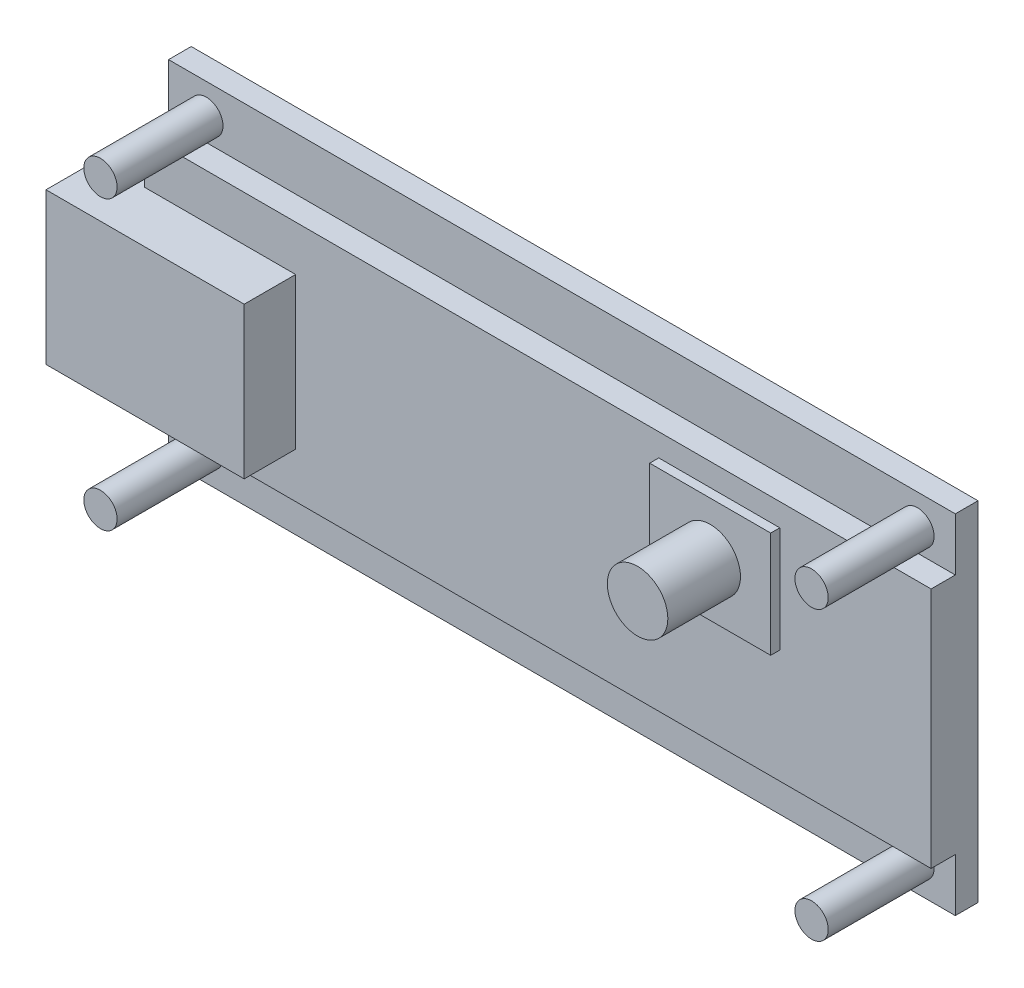
ISO-10303-21;
HEADER;
FILE_DESCRIPTION(('STEP AP214'),'2;1');
FILE_NAME('part.step','',(''),(''),'','','');
FILE_SCHEMA(('AUTOMOTIVE_DESIGN { 1 0 10303 214 1 1 1 1 }'));
ENDSEC;
DATA;
#1=APPLICATION_CONTEXT('core data for automotive mechanical design processes');
#2=APPLICATION_PROTOCOL_DEFINITION('international standard','automotive_design',2000,#1);
#3=PRODUCT_CONTEXT('',#1,'mechanical');
#4=PRODUCT('Part','Part','',(#3));
#5=PRODUCT_RELATED_PRODUCT_CATEGORY('part','',(#4));
#6=PRODUCT_DEFINITION_FORMATION('','',#4);
#7=PRODUCT_DEFINITION_CONTEXT('part definition',#1,'design');
#8=PRODUCT_DEFINITION('design','',#6,#7);
#9=PRODUCT_DEFINITION_SHAPE('','',#8);
#10=(LENGTH_UNIT() NAMED_UNIT(*) SI_UNIT(.MILLI.,.METRE.));
#11=(NAMED_UNIT(*) PLANE_ANGLE_UNIT() SI_UNIT($,.RADIAN.));
#12=(NAMED_UNIT(*) SI_UNIT($,.STERADIAN.) SOLID_ANGLE_UNIT());
#13=UNCERTAINTY_MEASURE_WITH_UNIT(LENGTH_MEASURE(1.E-05),#10,'distance_accuracy_value','');
#14=(GEOMETRIC_REPRESENTATION_CONTEXT(3) GLOBAL_UNCERTAINTY_ASSIGNED_CONTEXT((#13)) GLOBAL_UNIT_ASSIGNED_CONTEXT((#10,
#11,#12)) REPRESENTATION_CONTEXT('',''));
#15=CARTESIAN_POINT('',(0.,0.,0.));
#16=DIRECTION('',(0.,0.,1.));
#17=DIRECTION('',(1.,0.,0.));
#18=AXIS2_PLACEMENT_3D('',#15,#16,#17);
#19=CARTESIAN_POINT('',(0.,0.,-1.5));
#20=DIRECTION('',(-1.,0.,0.));
#21=DIRECTION('',(0.,0.,1.));
#22=AXIS2_PLACEMENT_3D('',#19,#20,#21);
#23=PLANE('',#22);
#24=DIRECTION('',(0.,-1.,0.));
#25=VECTOR('',#24,1.);
#26=CARTESIAN_POINT('',(0.,0.,-1.5));
#27=LINE('',#26,#25);
#28=CARTESIAN_POINT('',(0.,23.,-1.5));
#29=VERTEX_POINT('',#28);
#30=CARTESIAN_POINT('',(0.,16.5,-1.5));
#31=VERTEX_POINT('',#30);
#32=EDGE_CURVE('E278',#29,#31,#27,.T.);
#33=ORIENTED_EDGE('',*,*,#32,.T.);
#34=DIRECTION('',(0.,0.,1.));
#35=VECTOR('',#34,1.);
#36=CARTESIAN_POINT('',(0.,16.5,5.));
#37=LINE('',#36,#35);
#38=CARTESIAN_POINT('',(0.,16.5,1.6));
#39=VERTEX_POINT('',#38);
#40=EDGE_CURVE('E165',#31,#39,#37,.T.);
#41=ORIENTED_EDGE('',*,*,#40,.T.);
#42=DIRECTION('',(0.,-1.,0.));
#43=VECTOR('',#42,1.);
#44=CARTESIAN_POINT('',(0.,3.49999999999999,1.6));
#45=LINE('',#44,#43);
#46=CARTESIAN_POINT('',(0.,19.5,1.6));
#47=VERTEX_POINT('',#46);
#48=EDGE_CURVE('E229',#47,#39,#45,.T.);
#49=ORIENTED_EDGE('',*,*,#48,.F.);
#50=DIRECTION('',(0.,0.,-1.));
#51=VECTOR('',#50,1.);
#52=CARTESIAN_POINT('',(0.,19.5,1.6));
#53=LINE('',#52,#51);
#54=CARTESIAN_POINT('',(0.,19.5,0.));
#55=VERTEX_POINT('',#54);
#56=EDGE_CURVE('E240',#47,#55,#53,.T.);
#57=ORIENTED_EDGE('',*,*,#56,.T.);
#58=DIRECTION('',(0.,-1.,0.));
#59=VECTOR('',#58,1.);
#60=CARTESIAN_POINT('',(0.,0.,0.));
#61=LINE('',#60,#59);
#62=CARTESIAN_POINT('',(0.,23.,0.));
#63=VERTEX_POINT('',#62);
#64=EDGE_CURVE('E291',#63,#55,#61,.T.);
#65=ORIENTED_EDGE('',*,*,#64,.F.);
#66=DIRECTION('',(0.,0.,1.));
#67=VECTOR('',#66,1.);
#68=CARTESIAN_POINT('',(0.,23.,-1.5));
#69=LINE('',#68,#67);
#70=EDGE_CURVE('E304',#29,#63,#69,.T.);
#71=ORIENTED_EDGE('',*,*,#70,.F.);
#72=EDGE_LOOP('',(#33,#41,#49,#57,#65,#71));
#73=FACE_BOUND('',#72,.T.);
#74=ADVANCED_FACE('F35',(#73),#23,.T.);
#75=CARTESIAN_POINT('',(0.,0.,2.2));
#76=DIRECTION('',(0.,0.,1.));
#77=DIRECTION('',(1.,0.,0.));
#78=AXIS2_PLACEMENT_3D('',#75,#76,#77);
#79=PLANE('',#78);
#80=DIRECTION('',(1.,0.,0.));
#81=VECTOR('',#80,1.);
#82=CARTESIAN_POINT('',(34.,11.,2.2));
#83=LINE('',#82,#81);
#84=CARTESIAN_POINT('',(34.,11.,2.2));
#85=VERTEX_POINT('',#84);
#86=CARTESIAN_POINT('',(42.,11.,2.2));
#87=VERTEX_POINT('',#86);
#88=EDGE_CURVE('E198',#85,#87,#83,.T.);
#89=ORIENTED_EDGE('',*,*,#88,.T.);
#90=DIRECTION('',(0.,1.,0.));
#91=VECTOR('',#90,1.);
#92=CARTESIAN_POINT('',(42.,11.,2.2));
#93=LINE('',#92,#91);
#94=CARTESIAN_POINT('',(42.,18.,2.2));
#95=VERTEX_POINT('',#94);
#96=EDGE_CURVE('E201',#87,#95,#93,.T.);
#97=ORIENTED_EDGE('',*,*,#96,.T.);
#98=DIRECTION('',(1.,0.,0.));
#99=VECTOR('',#98,1.);
#100=CARTESIAN_POINT('',(34.,18.,2.2));
#101=LINE('',#100,#99);
#102=CARTESIAN_POINT('',(34.,18.,2.2));
#103=VERTEX_POINT('',#102);
#104=EDGE_CURVE('E203',#103,#95,#101,.T.);
#105=ORIENTED_EDGE('',*,*,#104,.F.);
#106=DIRECTION('',(0.,1.,0.));
#107=VECTOR('',#106,1.);
#108=CARTESIAN_POINT('',(34.,11.,2.2));
#109=LINE('',#108,#107);
#110=EDGE_CURVE('E206',#85,#103,#109,.T.);
#111=ORIENTED_EDGE('',*,*,#110,.F.);
#112=EDGE_LOOP('',(#89,#97,#105,#111));
#113=FACE_BOUND('',#112,.T.);
#114=CARTESIAN_POINT('',(38.,14.5,2.2));
#115=DIRECTION('',(0.,0.,1.));
#116=DIRECTION('',(1.,0.,0.));
#117=AXIS2_PLACEMENT_3D('',#114,#115,#116);
#118=CIRCLE('',#117,2.);
#119=CARTESIAN_POINT('',(40.,14.5,2.2));
#120=VERTEX_POINT('',#119);
#121=EDGE_CURVE('E39',#120,#120,#118,.F.);
#122=ORIENTED_EDGE('',*,*,#121,.T.);
#123=EDGE_LOOP('',(#122));
#124=FACE_BOUND('',#123,.T.);
#125=ADVANCED_FACE('F329',(#113,#124),#79,.T.);
#126=CARTESIAN_POINT('',(0.,0.,1.6));
#127=DIRECTION('',(0.,0.,1.));
#128=DIRECTION('',(1.,0.,0.));
#129=AXIS2_PLACEMENT_3D('',#126,#127,#128);
#130=PLANE('',#129);
#131=DIRECTION('',(1.,0.,0.));
#132=VECTOR('',#131,1.);
#133=CARTESIAN_POINT('',(-1.1,6.49999999999999,1.6));
#134=LINE('',#133,#132);
#135=CARTESIAN_POINT('',(0.,6.49999999999999,1.6));
#136=VERTEX_POINT('',#135);
#137=CARTESIAN_POINT('',(10.,6.49999999999999,1.6));
#138=VERTEX_POINT('',#137);
#139=EDGE_CURVE('E248',#136,#138,#134,.T.);
#140=ORIENTED_EDGE('',*,*,#139,.F.);
#141=CARTESIAN_POINT('',(0.,3.49999999999999,1.6));
#142=VERTEX_POINT('',#141);
#143=EDGE_CURVE('E228',#136,#142,#45,.T.);
#144=ORIENTED_EDGE('',*,*,#143,.T.);
#145=DIRECTION('',(1.,0.,0.));
#146=VECTOR('',#145,1.);
#147=CARTESIAN_POINT('',(52.,3.5,1.6));
#148=LINE('',#147,#146);
#149=CARTESIAN_POINT('',(52.,3.5,1.6));
#150=VERTEX_POINT('',#149);
#151=EDGE_CURVE('E231',#142,#150,#148,.T.);
#152=ORIENTED_EDGE('',*,*,#151,.T.);
#153=DIRECTION('',(0.,1.,0.));
#154=VECTOR('',#153,1.);
#155=CARTESIAN_POINT('',(52.,3.5,1.6));
#156=LINE('',#155,#154);
#157=CARTESIAN_POINT('',(52.,19.5,1.6));
#158=VERTEX_POINT('',#157);
#159=EDGE_CURVE('E222',#150,#158,#156,.T.);
#160=ORIENTED_EDGE('',*,*,#159,.T.);
#161=DIRECTION('',(-1.,0.,0.));
#162=VECTOR('',#161,1.);
#163=CARTESIAN_POINT('',(52.,19.5,1.6));
#164=LINE('',#163,#162);
#165=EDGE_CURVE('E225',#158,#47,#164,.T.);
#166=ORIENTED_EDGE('',*,*,#165,.T.);
#167=ORIENTED_EDGE('',*,*,#48,.T.);
#168=DIRECTION('',(-1.,0.,0.));
#169=VECTOR('',#168,1.);
#170=CARTESIAN_POINT('',(-1.1,16.5,1.6));
#171=LINE('',#170,#169);
#172=CARTESIAN_POINT('',(10.,16.5,1.6));
#173=VERTEX_POINT('',#172);
#174=EDGE_CURVE('E306',#173,#39,#171,.T.);
#175=ORIENTED_EDGE('',*,*,#174,.F.);
#176=DIRECTION('',(0.,1.,0.));
#177=VECTOR('',#176,1.);
#178=CARTESIAN_POINT('',(10.,16.5,1.6));
#179=LINE('',#178,#177);
#180=EDGE_CURVE('E245',#138,#173,#179,.T.);
#181=ORIENTED_EDGE('',*,*,#180,.F.);
#182=EDGE_LOOP('',(#140,#144,#152,#160,#166,#167,#175,#181));
#183=FACE_BOUND('',#182,.T.);
#184=DIRECTION('',(0.,-1.,0.));
#185=VECTOR('',#184,1.);
#186=CARTESIAN_POINT('',(42.,0.,1.6));
#187=LINE('',#186,#185);
#188=CARTESIAN_POINT('',(42.,18.,1.6));
#189=VERTEX_POINT('',#188);
#190=CARTESIAN_POINT('',(42.,11.,1.6));
#191=VERTEX_POINT('',#190);
#192=EDGE_CURVE('E44',#189,#191,#187,.T.);
#193=ORIENTED_EDGE('',*,*,#192,.T.);
#194=DIRECTION('',(-1.,0.,0.));
#195=VECTOR('',#194,1.);
#196=CARTESIAN_POINT('',(0.,11.,1.6));
#197=LINE('',#196,#195);
#198=CARTESIAN_POINT('',(34.,11.,1.6));
#199=VERTEX_POINT('',#198);
#200=EDGE_CURVE('E11',#191,#199,#197,.T.);
#201=ORIENTED_EDGE('',*,*,#200,.T.);
#202=DIRECTION('',(0.,-1.,0.));
#203=VECTOR('',#202,1.);
#204=CARTESIAN_POINT('',(34.,0.,1.6));
#205=LINE('',#204,#203);
#206=CARTESIAN_POINT('',(34.,18.,1.6));
#207=VERTEX_POINT('',#206);
#208=EDGE_CURVE('E316',#207,#199,#205,.T.);
#209=ORIENTED_EDGE('',*,*,#208,.F.);
#210=DIRECTION('',(-1.,0.,0.));
#211=VECTOR('',#210,1.);
#212=CARTESIAN_POINT('',(0.,18.,1.6));
#213=LINE('',#212,#211);
#214=EDGE_CURVE('E54',#189,#207,#213,.T.);
#215=ORIENTED_EDGE('',*,*,#214,.F.);
#216=EDGE_LOOP('',(#193,#201,#209,#215));
#217=FACE_BOUND('',#216,.T.);
#218=ADVANCED_FACE('F336',(#183,#217),#130,.T.);
#219=CARTESIAN_POINT('',(0.,0.,0.));
#220=DIRECTION('',(0.,0.,-1.));
#221=DIRECTION('',(-1.,0.,0.));
#222=AXIS2_PLACEMENT_3D('',#219,#220,#221);
#223=PLANE('',#222);
#224=CARTESIAN_POINT('',(49.5,21.,0.));
#225=DIRECTION('',(0.,0.,1.));
#226=DIRECTION('',(1.,0.,0.));
#227=AXIS2_PLACEMENT_3D('',#224,#225,#226);
#228=CIRCLE('',#227,1.1);
#229=CARTESIAN_POINT('',(50.6,21.,0.));
#230=VERTEX_POINT('',#229);
#231=EDGE_CURVE('E271',#230,#230,#228,.T.);
#232=ORIENTED_EDGE('',*,*,#231,.F.);
#233=EDGE_LOOP('',(#232));
#234=FACE_BOUND('',#233,.T.);
#235=CARTESIAN_POINT('',(2.5,21.,0.));
#236=DIRECTION('',(0.,0.,1.));
#237=DIRECTION('',(1.,0.,0.));
#238=AXIS2_PLACEMENT_3D('',#235,#236,#237);
#239=CIRCLE('',#238,1.1);
#240=CARTESIAN_POINT('',(3.6,21.,0.));
#241=VERTEX_POINT('',#240);
#242=EDGE_CURVE('E274',#241,#241,#239,.T.);
#243=ORIENTED_EDGE('',*,*,#242,.F.);
#244=EDGE_LOOP('',(#243));
#245=FACE_BOUND('',#244,.T.);
#246=DIRECTION('',(-1.,0.,0.));
#247=VECTOR('',#246,1.);
#248=CARTESIAN_POINT('',(52.,19.5,0.));
#249=LINE('',#248,#247);
#250=CARTESIAN_POINT('',(52.,19.5,0.));
#251=VERTEX_POINT('',#250);
#252=EDGE_CURVE('E221',#251,#55,#249,.T.);
#253=ORIENTED_EDGE('',*,*,#252,.F.);
#254=DIRECTION('',(0.,1.,0.));
#255=VECTOR('',#254,1.);
#256=CARTESIAN_POINT('',(52.,0.,0.));
#257=LINE('',#256,#255);
#258=CARTESIAN_POINT('',(52.,23.,0.));
#259=VERTEX_POINT('',#258);
#260=EDGE_CURVE('E297',#251,#259,#257,.T.);
#261=ORIENTED_EDGE('',*,*,#260,.T.);
#262=DIRECTION('',(-1.,0.,0.));
#263=VECTOR('',#262,1.);
#264=CARTESIAN_POINT('',(0.,23.,0.));
#265=LINE('',#264,#263);
#266=EDGE_CURVE('E301',#259,#63,#265,.T.);
#267=ORIENTED_EDGE('',*,*,#266,.T.);
#268=ORIENTED_EDGE('',*,*,#64,.T.);
#269=EDGE_LOOP('',(#253,#261,#267,#268));
#270=FACE_BOUND('',#269,.T.);
#271=ADVANCED_FACE('F338',(#234,#245,#270),#223,.F.);
#272=CARTESIAN_POINT('',(49.5,2.,0.));
#273=DIRECTION('',(0.,0.,1.));
#274=DIRECTION('',(1.,0.,0.));
#275=AXIS2_PLACEMENT_3D('',#272,#273,#274);
#276=CIRCLE('',#275,1.1);
#277=CARTESIAN_POINT('',(50.6,2.,0.));
#278=VERTEX_POINT('',#277);
#279=EDGE_CURVE('E265',#278,#278,#276,.T.);
#280=ORIENTED_EDGE('',*,*,#279,.F.);
#281=EDGE_LOOP('',(#280));
#282=FACE_BOUND('',#281,.T.);
#283=CARTESIAN_POINT('',(2.5,2.,0.));
#284=DIRECTION('',(0.,0.,1.));
#285=DIRECTION('',(1.,0.,0.));
#286=AXIS2_PLACEMENT_3D('',#283,#284,#285);
#287=CIRCLE('',#286,1.1);
#288=CARTESIAN_POINT('',(3.6,2.,0.));
#289=VERTEX_POINT('',#288);
#290=EDGE_CURVE('E268',#289,#289,#287,.T.);
#291=ORIENTED_EDGE('',*,*,#290,.F.);
#292=EDGE_LOOP('',(#291));
#293=FACE_BOUND('',#292,.T.);
#294=DIRECTION('',(1.,0.,0.));
#295=VECTOR('',#294,1.);
#296=CARTESIAN_POINT('',(52.,3.5,0.));
#297=LINE('',#296,#295);
#298=CARTESIAN_POINT('',(0.,3.49999999999999,0.));
#299=VERTEX_POINT('',#298);
#300=CARTESIAN_POINT('',(52.,3.5,0.));
#301=VERTEX_POINT('',#300);
#302=EDGE_CURVE('E226',#299,#301,#297,.T.);
#303=ORIENTED_EDGE('',*,*,#302,.F.);
#304=CARTESIAN_POINT('',(0.,0.,0.));
#305=VERTEX_POINT('',#304);
#306=EDGE_CURVE('E277',#299,#305,#61,.T.);
#307=ORIENTED_EDGE('',*,*,#306,.T.);
#308=DIRECTION('',(1.,0.,0.));
#309=VECTOR('',#308,1.);
#310=CARTESIAN_POINT('',(0.,0.,0.));
#311=LINE('',#310,#309);
#312=CARTESIAN_POINT('',(52.,0.,0.));
#313=VERTEX_POINT('',#312);
#314=EDGE_CURVE('E294',#305,#313,#311,.T.);
#315=ORIENTED_EDGE('',*,*,#314,.T.);
#316=EDGE_CURVE('E298',#313,#301,#257,.T.);
#317=ORIENTED_EDGE('',*,*,#316,.T.);
#318=EDGE_LOOP('',(#303,#307,#315,#317));
#319=FACE_BOUND('',#318,.T.);
#320=ADVANCED_FACE('F345',(#282,#293,#319),#223,.F.);
#321=CARTESIAN_POINT('',(-1.1,6.49999999999999,5.));
#322=DIRECTION('',(0.,1.,0.));
#323=DIRECTION('',(0.,0.,1.));
#324=AXIS2_PLACEMENT_3D('',#321,#322,#323);
#325=PLANE('',#324);
#326=DIRECTION('',(0.,0.,-1.));
#327=VECTOR('',#326,1.);
#328=CARTESIAN_POINT('',(0.,6.49999999999999,5.));
#329=LINE('',#328,#327);
#330=CARTESIAN_POINT('',(0.,6.49999999999999,-1.5));
#331=VERTEX_POINT('',#330);
#332=EDGE_CURVE('E251',#136,#331,#329,.T.);
#333=ORIENTED_EDGE('',*,*,#332,.F.);
#334=ORIENTED_EDGE('',*,*,#139,.T.);
#335=DIRECTION('',(0.,0.,-1.));
#336=VECTOR('',#335,1.);
#337=CARTESIAN_POINT('',(10.,6.49999999999999,5.));
#338=LINE('',#337,#336);
#339=CARTESIAN_POINT('',(10.,6.49999999999999,5.));
#340=VERTEX_POINT('',#339);
#341=EDGE_CURVE('E262',#340,#138,#338,.T.);
#342=ORIENTED_EDGE('',*,*,#341,.F.);
#343=DIRECTION('',(1.,0.,0.));
#344=VECTOR('',#343,1.);
#345=CARTESIAN_POINT('',(-1.1,6.49999999999999,5.));
#346=LINE('',#345,#344);
#347=CARTESIAN_POINT('',(-3.1,6.49999999999999,5.));
#348=VERTEX_POINT('',#347);
#349=EDGE_CURVE('E253',#348,#340,#346,.T.);
#350=ORIENTED_EDGE('',*,*,#349,.F.);
#351=DIRECTION('',(0.,0.,-1.));
#352=VECTOR('',#351,1.);
#353=CARTESIAN_POINT('',(-3.1,6.49999999999999,0.));
#354=LINE('',#353,#352);
#355=CARTESIAN_POINT('',(-3.1,6.49999999999999,-1.5));
#356=VERTEX_POINT('',#355);
#357=EDGE_CURVE('E180',#348,#356,#354,.T.);
#358=ORIENTED_EDGE('',*,*,#357,.T.);
#359=DIRECTION('',(1.,0.,0.));
#360=VECTOR('',#359,1.);
#361=CARTESIAN_POINT('',(-3.1,6.49999999999999,-1.5));
#362=LINE('',#361,#360);
#363=EDGE_CURVE('E170',#356,#331,#362,.T.);
#364=ORIENTED_EDGE('',*,*,#363,.T.);
#365=EDGE_LOOP('',(#333,#334,#342,#350,#358,#364));
#366=FACE_BOUND('',#365,.T.);
#367=ADVANCED_FACE('F365',(#366),#325,.F.);
#368=CARTESIAN_POINT('',(-1.1,16.5,5.));
#369=DIRECTION('',(0.,-1.,0.));
#370=DIRECTION('',(0.,0.,-1.));
#371=AXIS2_PLACEMENT_3D('',#368,#369,#370);
#372=PLANE('',#371);
#373=DIRECTION('',(0.,0.,1.));
#374=VECTOR('',#373,1.);
#375=CARTESIAN_POINT('',(-3.1,16.5,0.));
#376=LINE('',#375,#374);
#377=CARTESIAN_POINT('',(-3.1,16.5,-1.5));
#378=VERTEX_POINT('',#377);
#379=CARTESIAN_POINT('',(-3.1,16.5,5.));
#380=VERTEX_POINT('',#379);
#381=EDGE_CURVE('E162',#378,#380,#376,.T.);
#382=ORIENTED_EDGE('',*,*,#381,.T.);
#383=DIRECTION('',(-1.,0.,0.));
#384=VECTOR('',#383,1.);
#385=CARTESIAN_POINT('',(-1.1,16.5,5.));
#386=LINE('',#385,#384);
#387=CARTESIAN_POINT('',(10.,16.5,5.));
#388=VERTEX_POINT('',#387);
#389=EDGE_CURVE('E257',#388,#380,#386,.T.);
#390=ORIENTED_EDGE('',*,*,#389,.F.);
#391=DIRECTION('',(0.,0.,-1.));
#392=VECTOR('',#391,1.);
#393=CARTESIAN_POINT('',(10.,16.5,5.));
#394=LINE('',#393,#392);
#395=EDGE_CURVE('E259',#388,#173,#394,.T.);
#396=ORIENTED_EDGE('',*,*,#395,.T.);
#397=ORIENTED_EDGE('',*,*,#174,.T.);
#398=ORIENTED_EDGE('',*,*,#40,.F.);
#399=DIRECTION('',(1.,0.,0.));
#400=VECTOR('',#399,1.);
#401=CARTESIAN_POINT('',(-3.1,16.5,-1.5));
#402=LINE('',#401,#400);
#403=EDGE_CURVE('E157',#378,#31,#402,.T.);
#404=ORIENTED_EDGE('',*,*,#403,.F.);
#405=EDGE_LOOP('',(#382,#390,#396,#397,#398,#404));
#406=FACE_BOUND('',#405,.T.);
#407=ADVANCED_FACE('F159',(#406),#372,.F.);
#408=ORIENTED_EDGE('',*,*,#332,.T.);
#409=CARTESIAN_POINT('',(0.,0.,-1.5));
#410=VERTEX_POINT('',#409);
#411=EDGE_CURVE('E281',#331,#410,#27,.T.);
#412=ORIENTED_EDGE('',*,*,#411,.T.);
#413=DIRECTION('',(0.,0.,1.));
#414=VECTOR('',#413,1.);
#415=CARTESIAN_POINT('',(0.,0.,-1.5));
#416=LINE('',#415,#414);
#417=EDGE_CURVE('E290',#410,#305,#416,.T.);
#418=ORIENTED_EDGE('',*,*,#417,.T.);
#419=ORIENTED_EDGE('',*,*,#306,.F.);
#420=DIRECTION('',(0.,0.,-1.));
#421=VECTOR('',#420,1.);
#422=CARTESIAN_POINT('',(0.,3.49999999999999,1.6));
#423=LINE('',#422,#421);
#424=EDGE_CURVE('E238',#142,#299,#423,.T.);
#425=ORIENTED_EDGE('',*,*,#424,.F.);
#426=ORIENTED_EDGE('',*,*,#143,.F.);
#427=EDGE_LOOP('',(#408,#412,#418,#419,#425,#426));
#428=FACE_BOUND('',#427,.T.);
#429=ADVANCED_FACE('F37',(#428),#23,.T.);
#430=CARTESIAN_POINT('',(0.,23.,-1.5));
#431=DIRECTION('',(0.,1.,0.));
#432=DIRECTION('',(0.,0.,1.));
#433=AXIS2_PLACEMENT_3D('',#430,#431,#432);
#434=PLANE('',#433);
#435=ORIENTED_EDGE('',*,*,#266,.F.);
#436=DIRECTION('',(0.,0.,1.));
#437=VECTOR('',#436,1.);
#438=CARTESIAN_POINT('',(52.,23.,-1.5));
#439=LINE('',#438,#437);
#440=CARTESIAN_POINT('',(52.,23.,-1.5));
#441=VERTEX_POINT('',#440);
#442=EDGE_CURVE('E307',#441,#259,#439,.T.);
#443=ORIENTED_EDGE('',*,*,#442,.F.);
#444=DIRECTION('',(-1.,0.,0.));
#445=VECTOR('',#444,1.);
#446=CARTESIAN_POINT('',(0.,23.,-1.5));
#447=LINE('',#446,#445);
#448=EDGE_CURVE('E287',#441,#29,#447,.T.);
#449=ORIENTED_EDGE('',*,*,#448,.T.);
#450=ORIENTED_EDGE('',*,*,#70,.T.);
#451=EDGE_LOOP('',(#435,#443,#449,#450));
#452=FACE_BOUND('',#451,.T.);
#453=ADVANCED_FACE('F356',(#452),#434,.T.);
#454=CARTESIAN_POINT('',(52.,0.,-1.5));
#455=DIRECTION('',(1.,0.,0.));
#456=DIRECTION('',(0.,0.,-1.));
#457=AXIS2_PLACEMENT_3D('',#454,#455,#456);
#458=PLANE('',#457);
#459=ORIENTED_EDGE('',*,*,#316,.F.);
#460=DIRECTION('',(0.,0.,1.));
#461=VECTOR('',#460,1.);
#462=CARTESIAN_POINT('',(52.,0.,-1.5));
#463=LINE('',#462,#461);
#464=CARTESIAN_POINT('',(52.,0.,-1.5));
#465=VERTEX_POINT('',#464);
#466=EDGE_CURVE('E310',#465,#313,#463,.T.);
#467=ORIENTED_EDGE('',*,*,#466,.F.);
#468=DIRECTION('',(0.,1.,0.));
#469=VECTOR('',#468,1.);
#470=CARTESIAN_POINT('',(52.,0.,-1.5));
#471=LINE('',#470,#469);
#472=EDGE_CURVE('E284',#465,#441,#471,.T.);
#473=ORIENTED_EDGE('',*,*,#472,.T.);
#474=ORIENTED_EDGE('',*,*,#442,.T.);
#475=ORIENTED_EDGE('',*,*,#260,.F.);
#476=DIRECTION('',(0.,0.,-1.));
#477=VECTOR('',#476,1.);
#478=CARTESIAN_POINT('',(52.,19.5,1.6));
#479=LINE('',#478,#477);
#480=EDGE_CURVE('E243',#158,#251,#479,.T.);
#481=ORIENTED_EDGE('',*,*,#480,.F.);
#482=ORIENTED_EDGE('',*,*,#159,.F.);
#483=DIRECTION('',(0.,0.,-1.));
#484=VECTOR('',#483,1.);
#485=CARTESIAN_POINT('',(52.,3.5,1.6));
#486=LINE('',#485,#484);
#487=EDGE_CURVE('E233',#150,#301,#486,.T.);
#488=ORIENTED_EDGE('',*,*,#487,.T.);
#489=EDGE_LOOP('',(#459,#467,#473,#474,#475,#481,#482,#488));
#490=FACE_BOUND('',#489,.T.);
#491=ADVANCED_FACE('F362',(#490),#458,.T.);
#492=CARTESIAN_POINT('',(0.,0.,-1.5));
#493=DIRECTION('',(0.,-1.,0.));
#494=DIRECTION('',(0.,0.,-1.));
#495=AXIS2_PLACEMENT_3D('',#492,#493,#494);
#496=PLANE('',#495);
#497=ORIENTED_EDGE('',*,*,#314,.F.);
#498=ORIENTED_EDGE('',*,*,#417,.F.);
#499=DIRECTION('',(1.,0.,0.));
#500=VECTOR('',#499,1.);
#501=CARTESIAN_POINT('',(0.,0.,-1.5));
#502=LINE('',#501,#500);
#503=EDGE_CURVE('E280',#410,#465,#502,.T.);
#504=ORIENTED_EDGE('',*,*,#503,.T.);
#505=ORIENTED_EDGE('',*,*,#466,.T.);
#506=EDGE_LOOP('',(#497,#498,#504,#505));
#507=FACE_BOUND('',#506,.T.);
#508=ADVANCED_FACE('F377',(#507),#496,.T.);
#509=CARTESIAN_POINT('',(0.,0.,-1.5));
#510=DIRECTION('',(0.,0.,-1.));
#511=DIRECTION('',(-1.,0.,0.));
#512=AXIS2_PLACEMENT_3D('',#509,#510,#511);
#513=PLANE('',#512);
#514=ORIENTED_EDGE('',*,*,#32,.F.);
#515=ORIENTED_EDGE('',*,*,#448,.F.);
#516=ORIENTED_EDGE('',*,*,#472,.F.);
#517=ORIENTED_EDGE('',*,*,#503,.F.);
#518=ORIENTED_EDGE('',*,*,#411,.F.);
#519=ORIENTED_EDGE('',*,*,#363,.F.);
#520=DIRECTION('',(0.,-1.,0.));
#521=VECTOR('',#520,1.);
#522=CARTESIAN_POINT('',(-3.1,0.,-1.5));
#523=LINE('',#522,#521);
#524=EDGE_CURVE('E173',#378,#356,#523,.T.);
#525=ORIENTED_EDGE('',*,*,#524,.F.);
#526=ORIENTED_EDGE('',*,*,#403,.T.);
#527=EDGE_LOOP('',(#514,#515,#516,#517,#518,#519,#525,#526));
#528=FACE_BOUND('',#527,.T.);
#529=ADVANCED_FACE('F174',(#528),#513,.T.);
#530=CARTESIAN_POINT('',(10.,16.5,5.));
#531=DIRECTION('',(-1.,0.,0.));
#532=DIRECTION('',(0.,-1.,0.));
#533=AXIS2_PLACEMENT_3D('',#530,#531,#532);
#534=PLANE('',#533);
#535=ORIENTED_EDGE('',*,*,#341,.T.);
#536=ORIENTED_EDGE('',*,*,#180,.T.);
#537=ORIENTED_EDGE('',*,*,#395,.F.);
#538=DIRECTION('',(0.,1.,0.));
#539=VECTOR('',#538,1.);
#540=CARTESIAN_POINT('',(10.,16.5,5.));
#541=LINE('',#540,#539);
#542=EDGE_CURVE('E255',#340,#388,#541,.T.);
#543=ORIENTED_EDGE('',*,*,#542,.F.);
#544=EDGE_LOOP('',(#535,#536,#537,#543));
#545=FACE_BOUND('',#544,.T.);
#546=ADVANCED_FACE('F394',(#545),#534,.F.);
#547=CARTESIAN_POINT('',(0.,0.,5.));
#548=DIRECTION('',(0.,0.,1.));
#549=DIRECTION('',(1.,0.,0.));
#550=AXIS2_PLACEMENT_3D('',#547,#548,#549);
#551=PLANE('',#550);
#552=ORIENTED_EDGE('',*,*,#349,.T.);
#553=ORIENTED_EDGE('',*,*,#542,.T.);
#554=ORIENTED_EDGE('',*,*,#389,.T.);
#555=DIRECTION('',(0.,1.,0.));
#556=VECTOR('',#555,1.);
#557=CARTESIAN_POINT('',(-3.1,0.,5.));
#558=LINE('',#557,#556);
#559=EDGE_CURVE('E185',#348,#380,#558,.T.);
#560=ORIENTED_EDGE('',*,*,#559,.F.);
#561=EDGE_LOOP('',(#552,#553,#554,#560));
#562=FACE_BOUND('',#561,.T.);
#563=ADVANCED_FACE('F397',(#562),#551,.T.);
#564=CARTESIAN_POINT('',(52.,19.5,1.6));
#565=DIRECTION('',(0.,-1.,0.));
#566=DIRECTION('',(1.,0.,0.));
#567=AXIS2_PLACEMENT_3D('',#564,#565,#566);
#568=PLANE('',#567);
#569=ORIENTED_EDGE('',*,*,#252,.T.);
#570=ORIENTED_EDGE('',*,*,#56,.F.);
#571=ORIENTED_EDGE('',*,*,#165,.F.);
#572=ORIENTED_EDGE('',*,*,#480,.T.);
#573=EDGE_LOOP('',(#569,#570,#571,#572));
#574=FACE_BOUND('',#573,.T.);
#575=ADVANCED_FACE('F404',(#574),#568,.F.);
#576=CARTESIAN_POINT('',(52.,3.5,1.6));
#577=DIRECTION('',(0.,1.,0.));
#578=DIRECTION('',(-1.,0.,0.));
#579=AXIS2_PLACEMENT_3D('',#576,#577,#578);
#580=PLANE('',#579);
#581=ORIENTED_EDGE('',*,*,#302,.T.);
#582=ORIENTED_EDGE('',*,*,#487,.F.);
#583=ORIENTED_EDGE('',*,*,#151,.F.);
#584=ORIENTED_EDGE('',*,*,#424,.T.);
#585=EDGE_LOOP('',(#581,#582,#583,#584));
#586=FACE_BOUND('',#585,.T.);
#587=ADVANCED_FACE('F385',(#586),#580,.F.);
#588=CARTESIAN_POINT('',(34.,11.,2.2));
#589=DIRECTION('',(0.,1.,0.));
#590=DIRECTION('',(0.,0.,1.));
#591=AXIS2_PLACEMENT_3D('',#588,#589,#590);
#592=PLANE('',#591);
#593=ORIENTED_EDGE('',*,*,#200,.F.);
#594=DIRECTION('',(0.,0.,-1.));
#595=VECTOR('',#594,1.);
#596=CARTESIAN_POINT('',(42.,11.,2.2));
#597=LINE('',#596,#595);
#598=EDGE_CURVE('E218',#87,#191,#597,.T.);
#599=ORIENTED_EDGE('',*,*,#598,.F.);
#600=ORIENTED_EDGE('',*,*,#88,.F.);
#601=DIRECTION('',(0.,0.,-1.));
#602=VECTOR('',#601,1.);
#603=CARTESIAN_POINT('',(34.,11.,2.2));
#604=LINE('',#603,#602);
#605=EDGE_CURVE('E209',#85,#199,#604,.T.);
#606=ORIENTED_EDGE('',*,*,#605,.T.);
#607=EDGE_LOOP('',(#593,#599,#600,#606));
#608=FACE_BOUND('',#607,.T.);
#609=ADVANCED_FACE('F335',(#608),#592,.F.);
#610=CARTESIAN_POINT('',(42.,11.,2.2));
#611=DIRECTION('',(-1.,0.,0.));
#612=DIRECTION('',(0.,0.,1.));
#613=AXIS2_PLACEMENT_3D('',#610,#611,#612);
#614=PLANE('',#613);
#615=ORIENTED_EDGE('',*,*,#192,.F.);
#616=DIRECTION('',(0.,0.,-1.));
#617=VECTOR('',#616,1.);
#618=CARTESIAN_POINT('',(42.,18.,2.2));
#619=LINE('',#618,#617);
#620=EDGE_CURVE('E215',#95,#189,#619,.T.);
#621=ORIENTED_EDGE('',*,*,#620,.F.);
#622=ORIENTED_EDGE('',*,*,#96,.F.);
#623=ORIENTED_EDGE('',*,*,#598,.T.);
#624=EDGE_LOOP('',(#615,#621,#622,#623));
#625=FACE_BOUND('',#624,.T.);
#626=ADVANCED_FACE('F333',(#625),#614,.F.);
#627=CARTESIAN_POINT('',(34.,18.,2.2));
#628=DIRECTION('',(0.,1.,0.));
#629=DIRECTION('',(0.,0.,1.));
#630=AXIS2_PLACEMENT_3D('',#627,#628,#629);
#631=PLANE('',#630);
#632=ORIENTED_EDGE('',*,*,#620,.T.);
#633=ORIENTED_EDGE('',*,*,#214,.T.);
#634=DIRECTION('',(0.,0.,-1.));
#635=VECTOR('',#634,1.);
#636=CARTESIAN_POINT('',(34.,18.,2.2));
#637=LINE('',#636,#635);
#638=EDGE_CURVE('E212',#103,#207,#637,.T.);
#639=ORIENTED_EDGE('',*,*,#638,.F.);
#640=ORIENTED_EDGE('',*,*,#104,.T.);
#641=EDGE_LOOP('',(#632,#633,#639,#640));
#642=FACE_BOUND('',#641,.T.);
#643=ADVANCED_FACE('F321',(#642),#631,.T.);
#644=CARTESIAN_POINT('',(34.,11.,2.2));
#645=DIRECTION('',(-1.,0.,0.));
#646=DIRECTION('',(0.,0.,1.));
#647=AXIS2_PLACEMENT_3D('',#644,#645,#646);
#648=PLANE('',#647);
#649=ORIENTED_EDGE('',*,*,#638,.T.);
#650=ORIENTED_EDGE('',*,*,#208,.T.);
#651=ORIENTED_EDGE('',*,*,#605,.F.);
#652=ORIENTED_EDGE('',*,*,#110,.T.);
#653=EDGE_LOOP('',(#649,#650,#651,#652));
#654=FACE_BOUND('',#653,.T.);
#655=ADVANCED_FACE('F325',(#654),#648,.T.);
#656=CARTESIAN_POINT('',(38.,14.5,7.));
#657=DIRECTION('',(0.,0.,-1.));
#658=DIRECTION('',(-1.,0.,0.));
#659=AXIS2_PLACEMENT_3D('',#656,#657,#658);
#660=CYLINDRICAL_SURFACE('',#659,2.);
#661=ORIENTED_EDGE('',*,*,#121,.F.);
#662=EDGE_LOOP('',(#661));
#663=FACE_BOUND('',#662,.T.);
#664=CARTESIAN_POINT('',(38.,14.5,7.));
#665=DIRECTION('',(0.,0.,1.));
#666=DIRECTION('',(1.,0.,0.));
#667=AXIS2_PLACEMENT_3D('',#664,#665,#666);
#668=CIRCLE('',#667,2.);
#669=CARTESIAN_POINT('',(40.,14.5,7.));
#670=VERTEX_POINT('',#669);
#671=EDGE_CURVE('E169',#670,#670,#668,.T.);
#672=ORIENTED_EDGE('',*,*,#671,.F.);
#673=EDGE_LOOP('',(#672));
#674=FACE_BOUND('',#673,.T.);
#675=ADVANCED_FACE('F586',(#663,#674),#660,.T.);
#676=CARTESIAN_POINT('',(38.,14.5,7.));
#677=DIRECTION('',(0.,0.,1.));
#678=DIRECTION('',(1.,0.,0.));
#679=AXIS2_PLACEMENT_3D('',#676,#677,#678);
#680=PLANE('',#679);
#681=ORIENTED_EDGE('',*,*,#671,.T.);
#682=EDGE_LOOP('',(#681));
#683=FACE_BOUND('',#682,.T.);
#684=ADVANCED_FACE('F455',(#683),#680,.T.);
#685=CARTESIAN_POINT('',(-3.1,0.,0.));
#686=DIRECTION('',(1.,0.,0.));
#687=DIRECTION('',(0.,1.,0.));
#688=AXIS2_PLACEMENT_3D('',#685,#686,#687);
#689=PLANE('',#688);
#690=ORIENTED_EDGE('',*,*,#381,.F.);
#691=ORIENTED_EDGE('',*,*,#524,.T.);
#692=ORIENTED_EDGE('',*,*,#357,.F.);
#693=ORIENTED_EDGE('',*,*,#559,.T.);
#694=EDGE_LOOP('',(#690,#691,#692,#693));
#695=FACE_BOUND('',#694,.T.);
#696=ADVANCED_FACE('F183',(#695),#689,.F.);
#697=CARTESIAN_POINT('',(49.5,2.,7.));
#698=DIRECTION('',(0.,0.,-1.));
#699=DIRECTION('',(-1.,0.,0.));
#700=AXIS2_PLACEMENT_3D('',#697,#698,#699);
#701=CYLINDRICAL_SURFACE('',#700,1.1);
#702=CARTESIAN_POINT('',(49.5,2.,7.));
#703=DIRECTION('',(0.,0.,1.));
#704=DIRECTION('',(1.,0.,0.));
#705=AXIS2_PLACEMENT_3D('',#702,#703,#704);
#706=CIRCLE('',#705,1.1);
#707=CARTESIAN_POINT('',(50.6,2.,7.));
#708=VERTEX_POINT('',#707);
#709=EDGE_CURVE('E186',#708,#708,#706,.T.);
#710=ORIENTED_EDGE('',*,*,#709,.F.);
#711=EDGE_LOOP('',(#710));
#712=FACE_BOUND('',#711,.T.);
#713=ORIENTED_EDGE('',*,*,#279,.T.);
#714=EDGE_LOOP('',(#713));
#715=FACE_BOUND('',#714,.T.);
#716=ADVANCED_FACE('F454',(#712,#715),#701,.T.);
#717=CARTESIAN_POINT('',(49.5,2.,7.));
#718=DIRECTION('',(0.,0.,1.));
#719=DIRECTION('',(1.,0.,0.));
#720=AXIS2_PLACEMENT_3D('',#717,#718,#719);
#721=PLANE('',#720);
#722=ORIENTED_EDGE('',*,*,#709,.T.);
#723=EDGE_LOOP('',(#722));
#724=FACE_BOUND('',#723,.T.);
#725=ADVANCED_FACE('F468',(#724),#721,.T.);
#726=CARTESIAN_POINT('',(2.5,2.,7.));
#727=DIRECTION('',(0.,0.,-1.));
#728=DIRECTION('',(-1.,0.,0.));
#729=AXIS2_PLACEMENT_3D('',#726,#727,#728);
#730=CYLINDRICAL_SURFACE('',#729,1.1);
#731=CARTESIAN_POINT('',(2.5,2.,7.));
#732=DIRECTION('',(0.,0.,1.));
#733=DIRECTION('',(1.,0.,0.));
#734=AXIS2_PLACEMENT_3D('',#731,#732,#733);
#735=CIRCLE('',#734,1.1);
#736=CARTESIAN_POINT('',(3.6,2.,7.));
#737=VERTEX_POINT('',#736);
#738=EDGE_CURVE('E189',#737,#737,#735,.T.);
#739=ORIENTED_EDGE('',*,*,#738,.F.);
#740=EDGE_LOOP('',(#739));
#741=FACE_BOUND('',#740,.T.);
#742=ORIENTED_EDGE('',*,*,#290,.T.);
#743=EDGE_LOOP('',(#742));
#744=FACE_BOUND('',#743,.T.);
#745=ADVANCED_FACE('F476',(#741,#744),#730,.T.);
#746=CARTESIAN_POINT('',(2.5,2.,7.));
#747=DIRECTION('',(0.,0.,1.));
#748=DIRECTION('',(1.,0.,0.));
#749=AXIS2_PLACEMENT_3D('',#746,#747,#748);
#750=PLANE('',#749);
#751=ORIENTED_EDGE('',*,*,#738,.T.);
#752=EDGE_LOOP('',(#751));
#753=FACE_BOUND('',#752,.T.);
#754=ADVANCED_FACE('F484',(#753),#750,.T.);
#755=CARTESIAN_POINT('',(2.5,21.,7.));
#756=DIRECTION('',(0.,0.,-1.));
#757=DIRECTION('',(-1.,0.,0.));
#758=AXIS2_PLACEMENT_3D('',#755,#756,#757);
#759=CYLINDRICAL_SURFACE('',#758,1.1);
#760=CARTESIAN_POINT('',(2.5,21.,7.));
#761=DIRECTION('',(0.,0.,1.));
#762=DIRECTION('',(1.,0.,0.));
#763=AXIS2_PLACEMENT_3D('',#760,#761,#762);
#764=CIRCLE('',#763,1.1);
#765=CARTESIAN_POINT('',(3.6,21.,7.));
#766=VERTEX_POINT('',#765);
#767=EDGE_CURVE('E710',#766,#766,#764,.T.);
#768=ORIENTED_EDGE('',*,*,#767,.F.);
#769=EDGE_LOOP('',(#768));
#770=FACE_BOUND('',#769,.T.);
#771=ORIENTED_EDGE('',*,*,#242,.T.);
#772=EDGE_LOOP('',(#771));
#773=FACE_BOUND('',#772,.T.);
#774=ADVANCED_FACE('F492',(#770,#773),#759,.T.);
#775=CARTESIAN_POINT('',(2.5,21.,7.));
#776=DIRECTION('',(0.,0.,1.));
#777=DIRECTION('',(1.,0.,0.));
#778=AXIS2_PLACEMENT_3D('',#775,#776,#777);
#779=PLANE('',#778);
#780=ORIENTED_EDGE('',*,*,#767,.T.);
#781=EDGE_LOOP('',(#780));
#782=FACE_BOUND('',#781,.T.);
#783=ADVANCED_FACE('F500',(#782),#779,.T.);
#784=CARTESIAN_POINT('',(49.5,21.,7.));
#785=DIRECTION('',(0.,0.,-1.));
#786=DIRECTION('',(-1.,0.,0.));
#787=AXIS2_PLACEMENT_3D('',#784,#785,#786);
#788=CYLINDRICAL_SURFACE('',#787,1.1);
#789=CARTESIAN_POINT('',(49.5,21.,7.));
#790=DIRECTION('',(0.,0.,1.));
#791=DIRECTION('',(1.,0.,0.));
#792=AXIS2_PLACEMENT_3D('',#789,#790,#791);
#793=CIRCLE('',#792,1.1);
#794=CARTESIAN_POINT('',(50.6,21.,7.));
#795=VERTEX_POINT('',#794);
#796=EDGE_CURVE('E709',#795,#795,#793,.T.);
#797=ORIENTED_EDGE('',*,*,#796,.F.);
#798=EDGE_LOOP('',(#797));
#799=FACE_BOUND('',#798,.T.);
#800=ORIENTED_EDGE('',*,*,#231,.T.);
#801=EDGE_LOOP('',(#800));
#802=FACE_BOUND('',#801,.T.);
#803=ADVANCED_FACE('F508',(#799,#802),#788,.T.);
#804=CARTESIAN_POINT('',(49.5,21.,7.));
#805=DIRECTION('',(0.,0.,1.));
#806=DIRECTION('',(1.,0.,0.));
#807=AXIS2_PLACEMENT_3D('',#804,#805,#806);
#808=PLANE('',#807);
#809=ORIENTED_EDGE('',*,*,#796,.T.);
#810=EDGE_LOOP('',(#809));
#811=FACE_BOUND('',#810,.T.);
#812=ADVANCED_FACE('F516',(#811),#808,.T.);
#813=CLOSED_SHELL('',(#74,#125,#218,#271,#320,#367,#407,#429,#453,#491,#508,#529,#546,#563,#575,
#587,#609,#626,#643,#655,#675,#684,#696,#716,#725,#745,#754,#774,#783,#803,#812));
#814=MANIFOLD_SOLID_BREP('B2',#813);
#815=ADVANCED_BREP_SHAPE_REPRESENTATION('',(#18,#814),#14);
#816=SHAPE_DEFINITION_REPRESENTATION(#9,#815);
ENDSEC;
END-ISO-10303-21;
